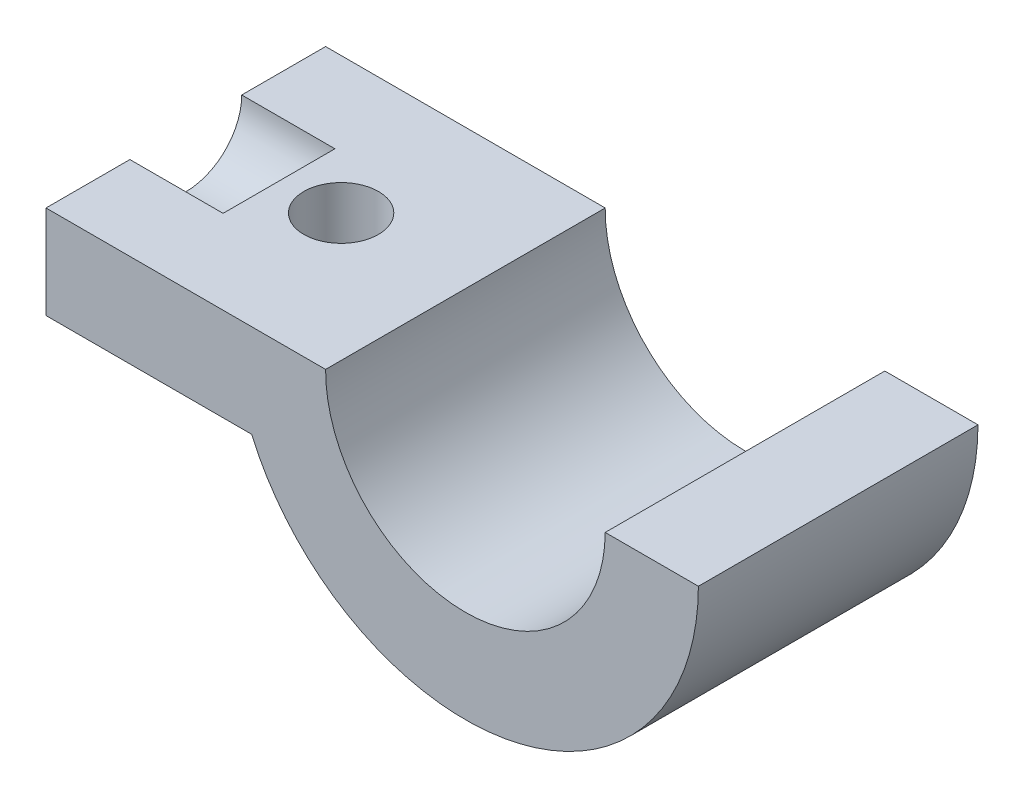
ISO-10303-21;
HEADER;
FILE_DESCRIPTION(('STEP AP214'),'2;1');
FILE_NAME('part.step','',(''),(''),'','','');
FILE_SCHEMA(('AUTOMOTIVE_DESIGN { 1 0 10303 214 1 1 1 1 }'));
ENDSEC;
DATA;
#1=APPLICATION_CONTEXT('core data for automotive mechanical design processes');
#2=APPLICATION_PROTOCOL_DEFINITION('international standard','automotive_design',2000,#1);
#3=PRODUCT_CONTEXT('',#1,'mechanical');
#4=PRODUCT('Part','Part','',(#3));
#5=PRODUCT_RELATED_PRODUCT_CATEGORY('part','',(#4));
#6=PRODUCT_DEFINITION_FORMATION('','',#4);
#7=PRODUCT_DEFINITION_CONTEXT('part definition',#1,'design');
#8=PRODUCT_DEFINITION('design','',#6,#7);
#9=PRODUCT_DEFINITION_SHAPE('','',#8);
#10=(LENGTH_UNIT() NAMED_UNIT(*) SI_UNIT(.MILLI.,.METRE.));
#11=(NAMED_UNIT(*) PLANE_ANGLE_UNIT() SI_UNIT($,.RADIAN.));
#12=(NAMED_UNIT(*) SI_UNIT($,.STERADIAN.) SOLID_ANGLE_UNIT());
#13=UNCERTAINTY_MEASURE_WITH_UNIT(LENGTH_MEASURE(1.E-05),#10,'distance_accuracy_value','');
#14=(GEOMETRIC_REPRESENTATION_CONTEXT(3) GLOBAL_UNCERTAINTY_ASSIGNED_CONTEXT((#13)) GLOBAL_UNIT_ASSIGNED_CONTEXT((#10,
#11,#12)) REPRESENTATION_CONTEXT('',''));
#15=CARTESIAN_POINT('',(0.,0.,0.));
#16=DIRECTION('',(0.,0.,1.));
#17=DIRECTION('',(1.,0.,0.));
#18=AXIS2_PLACEMENT_3D('',#15,#16,#17);
#19=CARTESIAN_POINT('',(9.49998601769128,-2.88693483854229,-1.5));
#20=DIRECTION('',(0.,-1.,0.));
#21=DIRECTION('',(0.,0.,-1.));
#22=AXIS2_PLACEMENT_3D('',#19,#20,#21);
#23=PLANE('',#22);
#24=CARTESIAN_POINT('',(8.56480931815895,-2.88693483854234,-0.768458184701557));
#25=DIRECTION('',(0.,1.,0.));
#26=DIRECTION('',(-1.,0.,0.));
#27=AXIS2_PLACEMENT_3D('',#24,#25,#26);
#28=CIRCLE('',#27,0.200000000000001);
#29=CARTESIAN_POINT('',(8.36480931815895,-2.88693483854234,-0.768458184701557));
#30=VERTEX_POINT('',#29);
#31=EDGE_CURVE('E167',#30,#30,#28,.T.);
#32=ORIENTED_EDGE('',*,*,#31,.T.);
#33=EDGE_LOOP('',(#32));
#34=FACE_BOUND('',#33,.T.);
#35=DIRECTION('',(1.,0.,0.));
#36=VECTOR('',#35,1.);
#37=CARTESIAN_POINT('',(9.49998601769128,-2.88693483854229,0.));
#38=LINE('',#37,#36);
#39=CARTESIAN_POINT('',(7.74999300884564,-2.88693483854229,0.));
#40=VERTEX_POINT('',#39);
#41=CARTESIAN_POINT('',(8.85312395513258,-2.88693483854229,0.));
#42=VERTEX_POINT('',#41);
#43=EDGE_CURVE('E130',#40,#42,#38,.T.);
#44=ORIENTED_EDGE('',*,*,#43,.F.);
#45=DIRECTION('',(0.,0.,1.));
#46=VECTOR('',#45,1.);
#47=CARTESIAN_POINT('',(7.74999300884564,-2.88693483854229,-1.5));
#48=LINE('',#47,#46);
#49=CARTESIAN_POINT('',(7.74999300884564,-2.88693483854229,-1.5));
#50=VERTEX_POINT('',#49);
#51=EDGE_CURVE('E55',#50,#40,#48,.T.);
#52=ORIENTED_EDGE('',*,*,#51,.F.);
#53=DIRECTION('',(1.,0.,0.));
#54=VECTOR('',#53,1.);
#55=CARTESIAN_POINT('',(9.49998601769128,-2.88693483854229,-1.5));
#56=LINE('',#55,#54);
#57=CARTESIAN_POINT('',(8.85312395513258,-2.88693483854229,-1.5));
#58=VERTEX_POINT('',#57);
#59=EDGE_CURVE('E145',#50,#58,#56,.T.);
#60=ORIENTED_EDGE('',*,*,#59,.T.);
#61=DIRECTION('',(0.,0.,1.));
#62=VECTOR('',#61,1.);
#63=CARTESIAN_POINT('',(8.85312395513258,-2.88693483854229,-1.5));
#64=LINE('',#63,#62);
#65=EDGE_CURVE('E88',#58,#42,#64,.T.);
#66=ORIENTED_EDGE('',*,*,#65,.T.);
#67=EDGE_LOOP('',(#44,#52,#60,#66));
#68=FACE_BOUND('',#67,.T.);
#69=ADVANCED_FACE('F33',(#34,#68),#23,.T.);
#70=CARTESIAN_POINT('',(7.74999300884564,-6.04625454426008,-1.5));
#71=DIRECTION('',(-1.,0.,0.));
#72=DIRECTION('',(0.,0.,1.));
#73=AXIS2_PLACEMENT_3D('',#70,#71,#72);
#74=PLANE('',#73);
#75=CARTESIAN_POINT('',(7.74999300884564,-2.38693483854229,-0.75));
#76=DIRECTION('',(-1.,0.,0.));
#77=DIRECTION('',(0.,0.,1.));
#78=AXIS2_PLACEMENT_3D('',#75,#76,#77);
#79=CIRCLE('',#78,0.3);
#80=CARTESIAN_POINT('',(7.74999300884564,-2.38693483854229,-1.05));
#81=VERTEX_POINT('',#80);
#82=CARTESIAN_POINT('',(7.74999300884564,-2.38693483854229,-0.45));
#83=VERTEX_POINT('',#82);
#84=EDGE_CURVE('E161',#81,#83,#79,.T.);
#85=ORIENTED_EDGE('',*,*,#84,.F.);
#86=DIRECTION('',(0.,0.,1.));
#87=VECTOR('',#86,1.);
#88=CARTESIAN_POINT('',(7.74999300884564,-2.38693483854229,-1.5));
#89=LINE('',#88,#87);
#90=CARTESIAN_POINT('',(7.74999300884564,-2.38693483854229,-1.5));
#91=VERTEX_POINT('',#90);
#92=EDGE_CURVE('E148',#91,#81,#89,.T.);
#93=ORIENTED_EDGE('',*,*,#92,.F.);
#94=DIRECTION('',(0.,-1.,0.));
#95=VECTOR('',#94,1.);
#96=CARTESIAN_POINT('',(7.74999300884564,-6.04625454426008,-1.5));
#97=LINE('',#96,#95);
#98=EDGE_CURVE('E125',#91,#50,#97,.T.);
#99=ORIENTED_EDGE('',*,*,#98,.T.);
#100=ORIENTED_EDGE('',*,*,#51,.T.);
#101=DIRECTION('',(0.,-1.,0.));
#102=VECTOR('',#101,1.);
#103=CARTESIAN_POINT('',(7.74999300884564,-6.04625454426008,0.));
#104=LINE('',#103,#102);
#105=CARTESIAN_POINT('',(7.74999300884564,-2.38693483854229,0.));
#106=VERTEX_POINT('',#105);
#107=EDGE_CURVE('E142',#106,#40,#104,.T.);
#108=ORIENTED_EDGE('',*,*,#107,.F.);
#109=EDGE_CURVE('E113',#83,#106,#89,.T.);
#110=ORIENTED_EDGE('',*,*,#109,.F.);
#111=EDGE_LOOP('',(#85,#93,#99,#100,#108,#110));
#112=FACE_BOUND('',#111,.T.);
#113=ADVANCED_FACE('F166',(#112),#74,.T.);
#114=CARTESIAN_POINT('',(9.49998601769127,-2.38693483854229,-1.5));
#115=DIRECTION('',(0.,1.,0.));
#116=DIRECTION('',(-1.,0.,0.));
#117=AXIS2_PLACEMENT_3D('',#114,#115,#116);
#118=PLANE('',#117);
#119=CARTESIAN_POINT('',(8.56480931815895,-2.38693483854234,-0.768458184701557));
#120=DIRECTION('',(0.,1.,0.));
#121=DIRECTION('',(-1.,0.,0.));
#122=AXIS2_PLACEMENT_3D('',#119,#120,#121);
#123=CIRCLE('',#122,0.200000000000001);
#124=CARTESIAN_POINT('',(8.36480931815895,-2.38693483854234,-0.768458184701557));
#125=VERTEX_POINT('',#124);
#126=EDGE_CURVE('E171',#125,#125,#123,.T.);
#127=ORIENTED_EDGE('',*,*,#126,.F.);
#128=EDGE_LOOP('',(#127));
#129=FACE_BOUND('',#128,.T.);
#130=DIRECTION('',(-1.,0.,0.));
#131=VECTOR('',#130,1.);
#132=CARTESIAN_POINT('',(8.24999300884564,-2.38693483854229,-1.05));
#133=LINE('',#132,#131);
#134=CARTESIAN_POINT('',(8.24999300884564,-2.38693483854229,-1.05));
#135=VERTEX_POINT('',#134);
#136=EDGE_CURVE('E11',#135,#81,#133,.T.);
#137=ORIENTED_EDGE('',*,*,#136,.F.);
#138=DIRECTION('',(0.,0.,1.));
#139=VECTOR('',#138,1.);
#140=CARTESIAN_POINT('',(8.24999300884564,-2.38693483854229,-1.5));
#141=LINE('',#140,#139);
#142=CARTESIAN_POINT('',(8.24999300884564,-2.38693483854229,-0.45));
#143=VERTEX_POINT('',#142);
#144=EDGE_CURVE('E147',#135,#143,#141,.T.);
#145=ORIENTED_EDGE('',*,*,#144,.T.);
#146=DIRECTION('',(-1.,0.,0.));
#147=VECTOR('',#146,1.);
#148=CARTESIAN_POINT('',(8.24999300884564,-2.38693483854229,-0.45));
#149=LINE('',#148,#147);
#150=EDGE_CURVE('E40',#83,#143,#149,.F.);
#151=ORIENTED_EDGE('',*,*,#150,.F.);
#152=ORIENTED_EDGE('',*,*,#109,.T.);
#153=DIRECTION('',(-1.,0.,0.));
#154=VECTOR('',#153,1.);
#155=CARTESIAN_POINT('',(9.49998601769127,-2.38693483854229,0.));
#156=LINE('',#155,#154);
#157=CARTESIAN_POINT('',(9.24999300884564,-2.38693483854229,0.));
#158=VERTEX_POINT('',#157);
#159=EDGE_CURVE('E110',#158,#106,#156,.T.);
#160=ORIENTED_EDGE('',*,*,#159,.F.);
#161=DIRECTION('',(0.,0.,1.));
#162=VECTOR('',#161,1.);
#163=CARTESIAN_POINT('',(9.24999300884564,-2.38693483854229,-1.5));
#164=LINE('',#163,#162);
#165=CARTESIAN_POINT('',(9.24999300884564,-2.38693483854229,-1.5));
#166=VERTEX_POINT('',#165);
#167=EDGE_CURVE('E101',#166,#158,#164,.T.);
#168=ORIENTED_EDGE('',*,*,#167,.F.);
#169=DIRECTION('',(-1.,0.,0.));
#170=VECTOR('',#169,1.);
#171=CARTESIAN_POINT('',(9.49998601769127,-2.38693483854229,-1.5));
#172=LINE('',#171,#170);
#173=EDGE_CURVE('E107',#166,#91,#172,.T.);
#174=ORIENTED_EDGE('',*,*,#173,.T.);
#175=ORIENTED_EDGE('',*,*,#92,.T.);
#176=EDGE_LOOP('',(#137,#145,#151,#152,#160,#168,#174,#175));
#177=FACE_BOUND('',#176,.T.);
#178=ADVANCED_FACE('F104',(#129,#177),#118,.T.);
#179=CARTESIAN_POINT('',(9.99998601769128,-2.39067412454957,-1.5));
#180=DIRECTION('',(0.,0.,1.));
#181=DIRECTION('',(1.,0.,0.));
#182=AXIS2_PLACEMENT_3D('',#179,#180,#181);
#183=CYLINDRICAL_SURFACE('',#182,0.750002330381167);
#184=CARTESIAN_POINT('',(9.99998601769128,-2.39067412454957,0.));
#185=DIRECTION('',(0.,0.,1.));
#186=DIRECTION('',(1.,0.,0.));
#187=AXIS2_PLACEMENT_3D('',#184,#185,#186);
#188=CIRCLE('',#187,0.750002330381167);
#189=CARTESIAN_POINT('',(10.7499790265369,-2.39441341055685,0.));
#190=VERTEX_POINT('',#189);
#191=EDGE_CURVE('E139',#158,#190,#188,.T.);
#192=ORIENTED_EDGE('',*,*,#191,.T.);
#193=DIRECTION('',(0.,0.,1.));
#194=VECTOR('',#193,1.);
#195=CARTESIAN_POINT('',(10.7499790265369,-2.39441341055685,-1.5));
#196=LINE('',#195,#194);
#197=CARTESIAN_POINT('',(10.7499790265369,-2.39441341055685,-1.5));
#198=VERTEX_POINT('',#197);
#199=EDGE_CURVE('E114',#198,#190,#196,.T.);
#200=ORIENTED_EDGE('',*,*,#199,.F.);
#201=CARTESIAN_POINT('',(9.99998601769128,-2.39067412454957,-1.5));
#202=DIRECTION('',(0.,0.,1.));
#203=DIRECTION('',(1.,0.,0.));
#204=AXIS2_PLACEMENT_3D('',#201,#202,#203);
#205=CIRCLE('',#204,0.750002330381167);
#206=EDGE_CURVE('E117',#166,#198,#205,.T.);
#207=ORIENTED_EDGE('',*,*,#206,.F.);
#208=ORIENTED_EDGE('',*,*,#167,.T.);
#209=EDGE_LOOP('',(#192,#200,#207,#208));
#210=FACE_BOUND('',#209,.T.);
#211=ADVANCED_FACE('F118',(#210),#183,.F.);
#212=CARTESIAN_POINT('',(9.49998601769128,-2.39441341055685,-1.5));
#213=DIRECTION('',(0.,-1.,0.));
#214=DIRECTION('',(0.,0.,-1.));
#215=AXIS2_PLACEMENT_3D('',#212,#213,#214);
#216=PLANE('',#215);
#217=DIRECTION('',(1.,0.,0.));
#218=VECTOR('',#217,1.);
#219=CARTESIAN_POINT('',(9.49998601769128,-2.39441341055685,0.));
#220=LINE('',#219,#218);
#221=CARTESIAN_POINT('',(11.2499790265369,-2.39441341055685,0.));
#222=VERTEX_POINT('',#221);
#223=EDGE_CURVE('E136',#190,#222,#220,.T.);
#224=ORIENTED_EDGE('',*,*,#223,.T.);
#225=DIRECTION('',(0.,0.,1.));
#226=VECTOR('',#225,1.);
#227=CARTESIAN_POINT('',(11.2499790265369,-2.39441341055685,-1.5));
#228=LINE('',#227,#226);
#229=CARTESIAN_POINT('',(11.2499790265369,-2.39441341055685,-1.5));
#230=VERTEX_POINT('',#229);
#231=EDGE_CURVE('E151',#230,#222,#228,.T.);
#232=ORIENTED_EDGE('',*,*,#231,.F.);
#233=DIRECTION('',(1.,0.,0.));
#234=VECTOR('',#233,1.);
#235=CARTESIAN_POINT('',(9.49998601769128,-2.39441341055685,-1.5));
#236=LINE('',#235,#234);
#237=EDGE_CURVE('E122',#198,#230,#236,.T.);
#238=ORIENTED_EDGE('',*,*,#237,.F.);
#239=ORIENTED_EDGE('',*,*,#199,.T.);
#240=EDGE_LOOP('',(#224,#232,#238,#239));
#241=FACE_BOUND('',#240,.T.);
#242=ADVANCED_FACE('F179',(#241),#216,.F.);
#243=CARTESIAN_POINT('',(9.99998776547987,-2.38973930304775,-1.5));
#244=DIRECTION('',(0.,0.,1.));
#245=DIRECTION('',(1.,0.,0.));
#246=AXIS2_PLACEMENT_3D('',#243,#244,#245);
#247=CYLINDRICAL_SURFACE('',#246,1.25);
#248=CARTESIAN_POINT('',(9.99998776547987,-2.38973930304775,0.));
#249=DIRECTION('',(0.,0.,1.));
#250=DIRECTION('',(1.,0.,0.));
#251=AXIS2_PLACEMENT_3D('',#248,#249,#250);
#252=CIRCLE('',#251,1.25);
#253=EDGE_CURVE('E133',#42,#222,#252,.T.);
#254=ORIENTED_EDGE('',*,*,#253,.F.);
#255=ORIENTED_EDGE('',*,*,#65,.F.);
#256=CARTESIAN_POINT('',(9.99998776547987,-2.38973930304775,-1.5));
#257=DIRECTION('',(0.,0.,1.));
#258=DIRECTION('',(1.,0.,0.));
#259=AXIS2_PLACEMENT_3D('',#256,#257,#258);
#260=CIRCLE('',#259,1.25);
#261=EDGE_CURVE('E176',#58,#230,#260,.T.);
#262=ORIENTED_EDGE('',*,*,#261,.T.);
#263=ORIENTED_EDGE('',*,*,#231,.T.);
#264=EDGE_LOOP('',(#254,#255,#262,#263));
#265=FACE_BOUND('',#264,.T.);
#266=ADVANCED_FACE('F181',(#265),#247,.T.);
#267=CARTESIAN_POINT('',(9.49998601769128,-6.04625454426008,-1.5));
#268=DIRECTION('',(0.,0.,1.));
#269=DIRECTION('',(1.,0.,0.));
#270=AXIS2_PLACEMENT_3D('',#267,#268,#269);
#271=PLANE('',#270);
#272=ORIENTED_EDGE('',*,*,#59,.F.);
#273=ORIENTED_EDGE('',*,*,#98,.F.);
#274=ORIENTED_EDGE('',*,*,#173,.F.);
#275=ORIENTED_EDGE('',*,*,#206,.T.);
#276=ORIENTED_EDGE('',*,*,#237,.T.);
#277=ORIENTED_EDGE('',*,*,#261,.F.);
#278=EDGE_LOOP('',(#272,#273,#274,#275,#276,#277));
#279=FACE_BOUND('',#278,.T.);
#280=ADVANCED_FACE('F124',(#279),#271,.F.);
#281=CARTESIAN_POINT('',(9.49998601769128,-6.04625454426008,0.));
#282=DIRECTION('',(0.,0.,1.));
#283=DIRECTION('',(1.,0.,0.));
#284=AXIS2_PLACEMENT_3D('',#281,#282,#283);
#285=PLANE('',#284);
#286=ORIENTED_EDGE('',*,*,#43,.T.);
#287=ORIENTED_EDGE('',*,*,#253,.T.);
#288=ORIENTED_EDGE('',*,*,#223,.F.);
#289=ORIENTED_EDGE('',*,*,#191,.F.);
#290=ORIENTED_EDGE('',*,*,#159,.T.);
#291=ORIENTED_EDGE('',*,*,#107,.T.);
#292=EDGE_LOOP('',(#286,#287,#288,#289,#290,#291));
#293=FACE_BOUND('',#292,.T.);
#294=ADVANCED_FACE('F187',(#293),#285,.T.);
#295=CARTESIAN_POINT('',(8.24999300884564,-2.38693483854229,-0.75));
#296=DIRECTION('',(-1.,0.,0.));
#297=DIRECTION('',(0.,0.,1.));
#298=AXIS2_PLACEMENT_3D('',#295,#296,#297);
#299=CYLINDRICAL_SURFACE('',#298,0.3);
#300=ORIENTED_EDGE('',*,*,#136,.T.);
#301=ORIENTED_EDGE('',*,*,#84,.T.);
#302=ORIENTED_EDGE('',*,*,#150,.T.);
#303=CARTESIAN_POINT('',(8.24999300884564,-2.38693483854229,-0.75));
#304=DIRECTION('',(-1.,0.,0.));
#305=DIRECTION('',(0.,0.,1.));
#306=AXIS2_PLACEMENT_3D('',#303,#304,#305);
#307=CIRCLE('',#306,0.3);
#308=EDGE_CURVE('E46',#135,#143,#307,.T.);
#309=ORIENTED_EDGE('',*,*,#308,.F.);
#310=EDGE_LOOP('',(#300,#301,#302,#309));
#311=FACE_BOUND('',#310,.T.);
#312=ADVANCED_FACE('F158',(#311),#299,.F.);
#313=CARTESIAN_POINT('',(8.24999300884564,-2.38693483854229,-0.75));
#314=DIRECTION('',(-1.,0.,0.));
#315=DIRECTION('',(0.,0.,1.));
#316=AXIS2_PLACEMENT_3D('',#313,#314,#315);
#317=PLANE('',#316);
#318=ORIENTED_EDGE('',*,*,#308,.T.);
#319=ORIENTED_EDGE('',*,*,#144,.F.);
#320=EDGE_LOOP('',(#318,#319));
#321=FACE_BOUND('',#320,.T.);
#322=ADVANCED_FACE('F163',(#321),#317,.T.);
#323=CARTESIAN_POINT('',(8.56480931815895,-2.88693483854234,-0.768458184701557));
#324=DIRECTION('',(0.,1.,0.));
#325=DIRECTION('',(-1.,0.,0.));
#326=AXIS2_PLACEMENT_3D('',#323,#324,#325);
#327=CYLINDRICAL_SURFACE('',#326,0.200000000000001);
#328=ORIENTED_EDGE('',*,*,#31,.F.);
#329=EDGE_LOOP('',(#328));
#330=FACE_BOUND('',#329,.T.);
#331=ORIENTED_EDGE('',*,*,#126,.T.);
#332=EDGE_LOOP('',(#331));
#333=FACE_BOUND('',#332,.T.);
#334=ADVANCED_FACE('F253',(#330,#333),#327,.F.);
#335=CLOSED_SHELL('',(#69,#113,#178,#211,#242,#266,#280,#294,#312,#322,#334));
#336=MANIFOLD_SOLID_BREP('B2',#335);
#337=ADVANCED_BREP_SHAPE_REPRESENTATION('',(#18,#336),#14);
#338=SHAPE_DEFINITION_REPRESENTATION(#9,#337);
ENDSEC;
END-ISO-10303-21;
